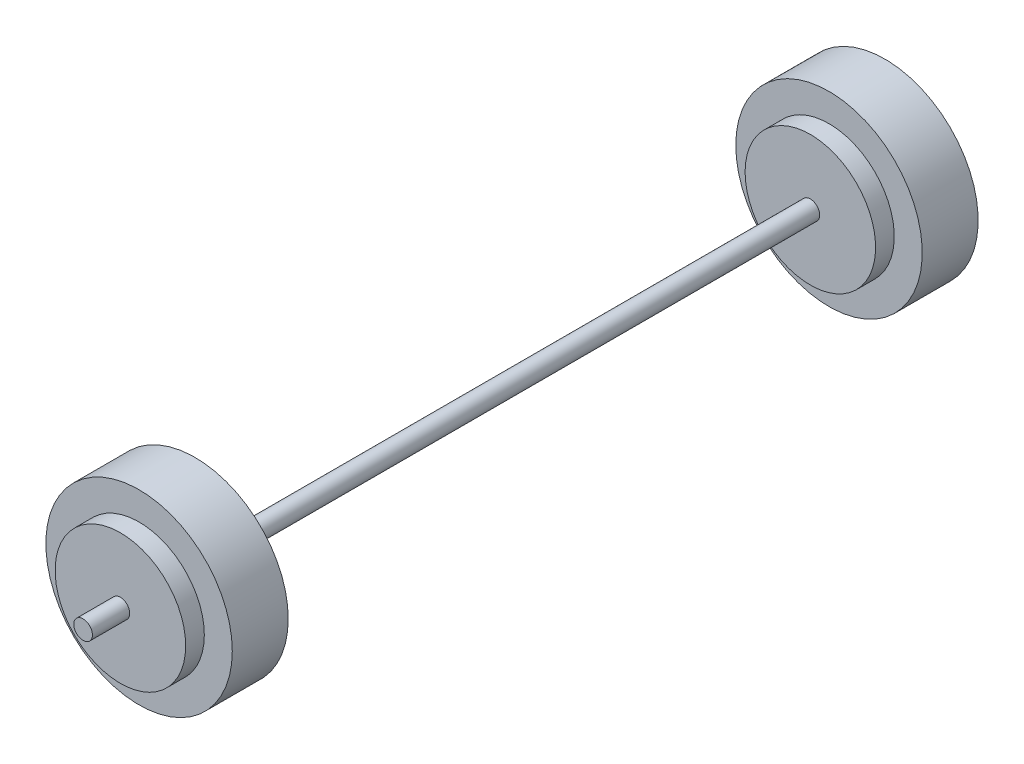
ISO-10303-21;
HEADER;
FILE_DESCRIPTION(('STEP AP214'),'2;1');
FILE_NAME('part.step','',(''),(''),'','','');
FILE_SCHEMA(('AUTOMOTIVE_DESIGN { 1 0 10303 214 1 1 1 1 }'));
ENDSEC;
DATA;
#1=APPLICATION_CONTEXT('core data for automotive mechanical design processes');
#2=APPLICATION_PROTOCOL_DEFINITION('international standard','automotive_design',2000,#1);
#3=PRODUCT_CONTEXT('',#1,'mechanical');
#4=PRODUCT('Part','Part','',(#3));
#5=PRODUCT_RELATED_PRODUCT_CATEGORY('part','',(#4));
#6=PRODUCT_DEFINITION_FORMATION('','',#4);
#7=PRODUCT_DEFINITION_CONTEXT('part definition',#1,'design');
#8=PRODUCT_DEFINITION('design','',#6,#7);
#9=PRODUCT_DEFINITION_SHAPE('','',#8);
#10=(LENGTH_UNIT() NAMED_UNIT(*) SI_UNIT(.MILLI.,.METRE.));
#11=(NAMED_UNIT(*) PLANE_ANGLE_UNIT() SI_UNIT($,.RADIAN.));
#12=(NAMED_UNIT(*) SI_UNIT($,.STERADIAN.) SOLID_ANGLE_UNIT());
#13=UNCERTAINTY_MEASURE_WITH_UNIT(LENGTH_MEASURE(1.E-05),#10,'distance_accuracy_value','');
#14=(GEOMETRIC_REPRESENTATION_CONTEXT(3) GLOBAL_UNCERTAINTY_ASSIGNED_CONTEXT((#13)) GLOBAL_UNIT_ASSIGNED_CONTEXT((#10,
#11,#12)) REPRESENTATION_CONTEXT('',''));
#15=CARTESIAN_POINT('',(0.,0.,0.));
#16=DIRECTION('',(0.,0.,1.));
#17=DIRECTION('',(1.,0.,0.));
#18=AXIS2_PLACEMENT_3D('',#15,#16,#17);
#19=CARTESIAN_POINT('',(0.,0.,-76.2));
#20=DIRECTION('',(0.,0.,1.));
#21=DIRECTION('',(1.,0.,0.));
#22=AXIS2_PLACEMENT_3D('',#19,#20,#21);
#23=CYLINDRICAL_SURFACE('',#22,127.);
#24=CARTESIAN_POINT('',(0.,0.,-76.2));
#25=DIRECTION('',(0.,0.,1.));
#26=DIRECTION('',(1.,0.,0.));
#27=AXIS2_PLACEMENT_3D('',#24,#25,#26);
#28=CIRCLE('',#27,127.);
#29=CARTESIAN_POINT('',(127.,0.,-76.2));
#30=VERTEX_POINT('',#29);
#31=EDGE_CURVE('E36',#30,#30,#28,.T.);
#32=ORIENTED_EDGE('',*,*,#31,.T.);
#33=EDGE_LOOP('',(#32));
#34=FACE_BOUND('',#33,.T.);
#35=CARTESIAN_POINT('',(0.,0.,0.));
#36=DIRECTION('',(0.,0.,1.));
#37=DIRECTION('',(1.,0.,0.));
#38=AXIS2_PLACEMENT_3D('',#35,#36,#37);
#39=CIRCLE('',#38,127.);
#40=CARTESIAN_POINT('',(127.,0.,0.));
#41=VERTEX_POINT('',#40);
#42=EDGE_CURVE('E40',#41,#41,#39,.T.);
#43=ORIENTED_EDGE('',*,*,#42,.F.);
#44=EDGE_LOOP('',(#43));
#45=FACE_BOUND('',#44,.T.);
#46=ADVANCED_FACE('F30',(#34,#45),#23,.T.);
#47=CARTESIAN_POINT('',(0.,0.,-76.2));
#48=DIRECTION('',(0.,0.,1.));
#49=DIRECTION('',(1.,0.,0.));
#50=AXIS2_PLACEMENT_3D('',#47,#48,#49);
#51=PLANE('',#50);
#52=CARTESIAN_POINT('',(0.,0.,-76.2));
#53=DIRECTION('',(0.,0.,1.));
#54=DIRECTION('',(1.,0.,0.));
#55=AXIS2_PLACEMENT_3D('',#52,#53,#54);
#56=CIRCLE('',#55,88.9);
#57=CARTESIAN_POINT('',(88.9,0.,-76.2));
#58=VERTEX_POINT('',#57);
#59=EDGE_CURVE('E10',#58,#58,#56,.F.);
#60=ORIENTED_EDGE('',*,*,#59,.F.);
#61=EDGE_LOOP('',(#60));
#62=FACE_BOUND('',#61,.T.);
#63=ORIENTED_EDGE('',*,*,#31,.F.);
#64=EDGE_LOOP('',(#63));
#65=FACE_BOUND('',#64,.T.);
#66=ADVANCED_FACE('F132',(#62,#65),#51,.F.);
#67=CARTESIAN_POINT('',(0.,0.,0.));
#68=DIRECTION('',(0.,0.,1.));
#69=DIRECTION('',(1.,0.,0.));
#70=AXIS2_PLACEMENT_3D('',#67,#68,#69);
#71=PLANE('',#70);
#72=CARTESIAN_POINT('',(0.,0.,0.));
#73=DIRECTION('',(0.,0.,1.));
#74=DIRECTION('',(1.,0.,0.));
#75=AXIS2_PLACEMENT_3D('',#72,#73,#74);
#76=CIRCLE('',#75,88.9);
#77=CARTESIAN_POINT('',(88.9,0.,0.));
#78=VERTEX_POINT('',#77);
#79=EDGE_CURVE('E47',#78,#78,#76,.T.);
#80=ORIENTED_EDGE('',*,*,#79,.F.);
#81=EDGE_LOOP('',(#80));
#82=FACE_BOUND('',#81,.T.);
#83=ORIENTED_EDGE('',*,*,#42,.T.);
#84=EDGE_LOOP('',(#83));
#85=FACE_BOUND('',#84,.T.);
#86=ADVANCED_FACE('F136',(#82,#85),#71,.T.);
#87=CARTESIAN_POINT('',(0.,0.,25.4));
#88=DIRECTION('',(0.,0.,-1.));
#89=DIRECTION('',(-1.,0.,0.));
#90=AXIS2_PLACEMENT_3D('',#87,#88,#89);
#91=CYLINDRICAL_SURFACE('',#90,88.9);
#92=CARTESIAN_POINT('',(0.,0.,25.4));
#93=DIRECTION('',(0.,0.,1.));
#94=DIRECTION('',(1.,0.,0.));
#95=AXIS2_PLACEMENT_3D('',#92,#93,#94);
#96=CIRCLE('',#95,88.9);
#97=CARTESIAN_POINT('',(88.9,0.,25.4));
#98=VERTEX_POINT('',#97);
#99=EDGE_CURVE('E45',#98,#98,#96,.T.);
#100=ORIENTED_EDGE('',*,*,#99,.F.);
#101=EDGE_LOOP('',(#100));
#102=FACE_BOUND('',#101,.T.);
#103=ORIENTED_EDGE('',*,*,#79,.T.);
#104=EDGE_LOOP('',(#103));
#105=FACE_BOUND('',#104,.T.);
#106=ADVANCED_FACE('F143',(#102,#105),#91,.T.);
#107=CARTESIAN_POINT('',(0.,0.,25.4));
#108=DIRECTION('',(0.,0.,1.));
#109=DIRECTION('',(1.,0.,0.));
#110=AXIS2_PLACEMENT_3D('',#107,#108,#109);
#111=PLANE('',#110);
#112=CARTESIAN_POINT('',(0.,0.,25.4));
#113=DIRECTION('',(0.,0.,1.));
#114=DIRECTION('',(1.,0.,0.));
#115=AXIS2_PLACEMENT_3D('',#112,#113,#114);
#116=CIRCLE('',#115,12.7);
#117=CARTESIAN_POINT('',(12.7,0.,25.4));
#118=VERTEX_POINT('',#117);
#119=EDGE_CURVE('E53',#118,#118,#116,.T.);
#120=ORIENTED_EDGE('',*,*,#119,.F.);
#121=EDGE_LOOP('',(#120));
#122=FACE_BOUND('',#121,.T.);
#123=ORIENTED_EDGE('',*,*,#99,.T.);
#124=EDGE_LOOP('',(#123));
#125=FACE_BOUND('',#124,.T.);
#126=ADVANCED_FACE('F148',(#122,#125),#111,.T.);
#127=CARTESIAN_POINT('',(0.,0.,76.2));
#128=DIRECTION('',(0.,0.,-1.));
#129=DIRECTION('',(-1.,0.,0.));
#130=AXIS2_PLACEMENT_3D('',#127,#128,#129);
#131=CYLINDRICAL_SURFACE('',#130,12.7);
#132=CARTESIAN_POINT('',(0.,0.,76.2));
#133=DIRECTION('',(0.,0.,1.));
#134=DIRECTION('',(1.,0.,0.));
#135=AXIS2_PLACEMENT_3D('',#132,#133,#134);
#136=CIRCLE('',#135,12.7);
#137=CARTESIAN_POINT('',(12.7,0.,76.2));
#138=VERTEX_POINT('',#137);
#139=EDGE_CURVE('E50',#138,#138,#136,.T.);
#140=ORIENTED_EDGE('',*,*,#139,.F.);
#141=EDGE_LOOP('',(#140));
#142=FACE_BOUND('',#141,.T.);
#143=ORIENTED_EDGE('',*,*,#119,.T.);
#144=EDGE_LOOP('',(#143));
#145=FACE_BOUND('',#144,.T.);
#146=ADVANCED_FACE('F155',(#142,#145),#131,.T.);
#147=CARTESIAN_POINT('',(0.,0.,76.2));
#148=DIRECTION('',(0.,0.,1.));
#149=DIRECTION('',(1.,0.,0.));
#150=AXIS2_PLACEMENT_3D('',#147,#148,#149);
#151=PLANE('',#150);
#152=ORIENTED_EDGE('',*,*,#139,.T.);
#153=EDGE_LOOP('',(#152));
#154=FACE_BOUND('',#153,.T.);
#155=ADVANCED_FACE('F159',(#154),#151,.T.);
#156=CARTESIAN_POINT('',(0.,0.,-101.6));
#157=DIRECTION('',(0.,0.,1.));
#158=DIRECTION('',(1.,0.,0.));
#159=AXIS2_PLACEMENT_3D('',#156,#157,#158);
#160=CYLINDRICAL_SURFACE('',#159,88.9);
#161=CARTESIAN_POINT('',(0.,0.,-101.6));
#162=DIRECTION('',(0.,0.,-1.));
#163=DIRECTION('',(-1.,0.,0.));
#164=AXIS2_PLACEMENT_3D('',#161,#162,#163);
#165=CIRCLE('',#164,88.9);
#166=CARTESIAN_POINT('',(-88.9,0.,-101.6));
#167=VERTEX_POINT('',#166);
#168=EDGE_CURVE('E56',#167,#167,#165,.T.);
#169=ORIENTED_EDGE('',*,*,#168,.F.);
#170=EDGE_LOOP('',(#169));
#171=FACE_BOUND('',#170,.T.);
#172=ORIENTED_EDGE('',*,*,#59,.T.);
#173=EDGE_LOOP('',(#172));
#174=FACE_BOUND('',#173,.T.);
#175=ADVANCED_FACE('F163',(#171,#174),#160,.T.);
#176=CARTESIAN_POINT('',(0.,0.,-101.6));
#177=DIRECTION('',(0.,0.,-1.));
#178=DIRECTION('',(-1.,0.,0.));
#179=AXIS2_PLACEMENT_3D('',#176,#177,#178);
#180=PLANE('',#179);
#181=CARTESIAN_POINT('',(0.,0.,-101.6));
#182=DIRECTION('',(0.,0.,-1.));
#183=DIRECTION('',(-1.,0.,0.));
#184=AXIS2_PLACEMENT_3D('',#181,#182,#183);
#185=CIRCLE('',#184,12.7);
#186=CARTESIAN_POINT('',(-12.7,0.,-101.6));
#187=VERTEX_POINT('',#186);
#188=EDGE_CURVE('E62',#187,#187,#185,.T.);
#189=ORIENTED_EDGE('',*,*,#188,.F.);
#190=EDGE_LOOP('',(#189));
#191=FACE_BOUND('',#190,.T.);
#192=ORIENTED_EDGE('',*,*,#168,.T.);
#193=EDGE_LOOP('',(#192));
#194=FACE_BOUND('',#193,.T.);
#195=ADVANCED_FACE('F167',(#191,#194),#180,.T.);
#196=CARTESIAN_POINT('',(0.,0.,-914.4));
#197=DIRECTION('',(0.,0.,1.));
#198=DIRECTION('',(1.,0.,0.));
#199=AXIS2_PLACEMENT_3D('',#196,#197,#198);
#200=CYLINDRICAL_SURFACE('',#199,12.7);
#201=CARTESIAN_POINT('',(0.,0.,-914.4));
#202=DIRECTION('',(0.,0.,-1.));
#203=DIRECTION('',(-1.,0.,0.));
#204=AXIS2_PLACEMENT_3D('',#201,#202,#203);
#205=CIRCLE('',#204,12.7);
#206=CARTESIAN_POINT('',(-12.7,0.,-914.4));
#207=VERTEX_POINT('',#206);
#208=EDGE_CURVE('E61',#207,#207,#205,.T.);
#209=ORIENTED_EDGE('',*,*,#208,.F.);
#210=EDGE_LOOP('',(#209));
#211=FACE_BOUND('',#210,.T.);
#212=ORIENTED_EDGE('',*,*,#188,.T.);
#213=EDGE_LOOP('',(#212));
#214=FACE_BOUND('',#213,.T.);
#215=ADVANCED_FACE('F171',(#211,#214),#200,.T.);
#216=CARTESIAN_POINT('',(0.,0.,-939.8));
#217=DIRECTION('',(0.,0.,1.));
#218=DIRECTION('',(1.,0.,0.));
#219=AXIS2_PLACEMENT_3D('',#216,#217,#218);
#220=CYLINDRICAL_SURFACE('',#219,88.9);
#221=CARTESIAN_POINT('',(0.,0.,-939.8));
#222=DIRECTION('',(0.,0.,-1.));
#223=DIRECTION('',(-1.,0.,0.));
#224=AXIS2_PLACEMENT_3D('',#221,#222,#223);
#225=CIRCLE('',#224,88.9);
#226=CARTESIAN_POINT('',(-88.9,0.,-939.8));
#227=VERTEX_POINT('',#226);
#228=EDGE_CURVE('E65',#227,#227,#225,.T.);
#229=ORIENTED_EDGE('',*,*,#228,.F.);
#230=EDGE_LOOP('',(#229));
#231=FACE_BOUND('',#230,.T.);
#232=CARTESIAN_POINT('',(0.,0.,-914.4));
#233=DIRECTION('',(0.,0.,-1.));
#234=DIRECTION('',(-1.,0.,0.));
#235=AXIS2_PLACEMENT_3D('',#232,#233,#234);
#236=CIRCLE('',#235,88.9);
#237=CARTESIAN_POINT('',(-88.9,0.,-914.4));
#238=VERTEX_POINT('',#237);
#239=EDGE_CURVE('E68',#238,#238,#236,.T.);
#240=ORIENTED_EDGE('',*,*,#239,.T.);
#241=EDGE_LOOP('',(#240));
#242=FACE_BOUND('',#241,.T.);
#243=ADVANCED_FACE('F175',(#231,#242),#220,.T.);
#244=CARTESIAN_POINT('',(0.,0.,-914.4));
#245=DIRECTION('',(0.,0.,-1.));
#246=DIRECTION('',(-1.,0.,0.));
#247=AXIS2_PLACEMENT_3D('',#244,#245,#246);
#248=PLANE('',#247);
#249=ORIENTED_EDGE('',*,*,#208,.T.);
#250=EDGE_LOOP('',(#249));
#251=FACE_BOUND('',#250,.T.);
#252=ORIENTED_EDGE('',*,*,#239,.F.);
#253=EDGE_LOOP('',(#252));
#254=FACE_BOUND('',#253,.T.);
#255=ADVANCED_FACE('F122',(#251,#254),#248,.F.);
#256=CARTESIAN_POINT('',(0.,0.,-1016.));
#257=DIRECTION('',(0.,0.,1.));
#258=DIRECTION('',(1.,0.,0.));
#259=AXIS2_PLACEMENT_3D('',#256,#257,#258);
#260=CYLINDRICAL_SURFACE('',#259,127.);
#261=CARTESIAN_POINT('',(0.,0.,-1016.));
#262=DIRECTION('',(0.,0.,-1.));
#263=DIRECTION('',(-1.,0.,0.));
#264=AXIS2_PLACEMENT_3D('',#261,#262,#263);
#265=CIRCLE('',#264,127.);
#266=CARTESIAN_POINT('',(-127.,0.,-1016.));
#267=VERTEX_POINT('',#266);
#268=EDGE_CURVE('E71',#267,#267,#265,.T.);
#269=ORIENTED_EDGE('',*,*,#268,.F.);
#270=EDGE_LOOP('',(#269));
#271=FACE_BOUND('',#270,.T.);
#272=CARTESIAN_POINT('',(0.,0.,-939.8));
#273=DIRECTION('',(0.,0.,-1.));
#274=DIRECTION('',(-1.,0.,0.));
#275=AXIS2_PLACEMENT_3D('',#272,#273,#274);
#276=CIRCLE('',#275,127.);
#277=CARTESIAN_POINT('',(-127.,0.,-939.8));
#278=VERTEX_POINT('',#277);
#279=EDGE_CURVE('E74',#278,#278,#276,.T.);
#280=ORIENTED_EDGE('',*,*,#279,.T.);
#281=EDGE_LOOP('',(#280));
#282=FACE_BOUND('',#281,.T.);
#283=ADVANCED_FACE('F116',(#271,#282),#260,.T.);
#284=CARTESIAN_POINT('',(0.,0.,-1016.));
#285=DIRECTION('',(0.,0.,-1.));
#286=DIRECTION('',(-1.,0.,0.));
#287=AXIS2_PLACEMENT_3D('',#284,#285,#286);
#288=PLANE('',#287);
#289=CARTESIAN_POINT('',(0.,0.,-1016.));
#290=DIRECTION('',(0.,0.,-1.));
#291=DIRECTION('',(-1.,0.,0.));
#292=AXIS2_PLACEMENT_3D('',#289,#290,#291);
#293=CIRCLE('',#292,88.9);
#294=CARTESIAN_POINT('',(-88.9,0.,-1016.));
#295=VERTEX_POINT('',#294);
#296=EDGE_CURVE('E80',#295,#295,#293,.T.);
#297=ORIENTED_EDGE('',*,*,#296,.F.);
#298=EDGE_LOOP('',(#297));
#299=FACE_BOUND('',#298,.T.);
#300=ORIENTED_EDGE('',*,*,#268,.T.);
#301=EDGE_LOOP('',(#300));
#302=FACE_BOUND('',#301,.T.);
#303=ADVANCED_FACE('F113',(#299,#302),#288,.T.);
#304=CARTESIAN_POINT('',(0.,0.,-939.8));
#305=DIRECTION('',(0.,0.,-1.));
#306=DIRECTION('',(-1.,0.,0.));
#307=AXIS2_PLACEMENT_3D('',#304,#305,#306);
#308=PLANE('',#307);
#309=ORIENTED_EDGE('',*,*,#228,.T.);
#310=EDGE_LOOP('',(#309));
#311=FACE_BOUND('',#310,.T.);
#312=ORIENTED_EDGE('',*,*,#279,.F.);
#313=EDGE_LOOP('',(#312));
#314=FACE_BOUND('',#313,.T.);
#315=ADVANCED_FACE('F109',(#311,#314),#308,.F.);
#316=CARTESIAN_POINT('',(0.,0.,-1041.4));
#317=DIRECTION('',(0.,0.,1.));
#318=DIRECTION('',(1.,0.,0.));
#319=AXIS2_PLACEMENT_3D('',#316,#317,#318);
#320=CYLINDRICAL_SURFACE('',#319,88.9);
#321=CARTESIAN_POINT('',(0.,0.,-1041.4));
#322=DIRECTION('',(0.,0.,-1.));
#323=DIRECTION('',(-1.,0.,0.));
#324=AXIS2_PLACEMENT_3D('',#321,#322,#323);
#325=CIRCLE('',#324,88.9);
#326=CARTESIAN_POINT('',(-88.9,0.,-1041.4));
#327=VERTEX_POINT('',#326);
#328=EDGE_CURVE('E77',#327,#327,#325,.T.);
#329=ORIENTED_EDGE('',*,*,#328,.F.);
#330=EDGE_LOOP('',(#329));
#331=FACE_BOUND('',#330,.T.);
#332=ORIENTED_EDGE('',*,*,#296,.T.);
#333=EDGE_LOOP('',(#332));
#334=FACE_BOUND('',#333,.T.);
#335=ADVANCED_FACE('F103',(#331,#334),#320,.T.);
#336=CARTESIAN_POINT('',(0.,0.,-1041.4));
#337=DIRECTION('',(0.,0.,-1.));
#338=DIRECTION('',(-1.,0.,0.));
#339=AXIS2_PLACEMENT_3D('',#336,#337,#338);
#340=PLANE('',#339);
#341=CARTESIAN_POINT('',(0.,0.,-1041.4));
#342=DIRECTION('',(0.,0.,-1.));
#343=DIRECTION('',(-1.,0.,0.));
#344=AXIS2_PLACEMENT_3D('',#341,#342,#343);
#345=CIRCLE('',#344,12.7);
#346=CARTESIAN_POINT('',(-12.7,0.,-1041.4));
#347=VERTEX_POINT('',#346);
#348=EDGE_CURVE('E86',#347,#347,#345,.T.);
#349=ORIENTED_EDGE('',*,*,#348,.F.);
#350=EDGE_LOOP('',(#349));
#351=FACE_BOUND('',#350,.T.);
#352=ORIENTED_EDGE('',*,*,#328,.T.);
#353=EDGE_LOOP('',(#352));
#354=FACE_BOUND('',#353,.T.);
#355=ADVANCED_FACE('F97',(#351,#354),#340,.T.);
#356=CARTESIAN_POINT('',(0.,0.,-1092.2));
#357=DIRECTION('',(0.,0.,1.));
#358=DIRECTION('',(1.,0.,0.));
#359=AXIS2_PLACEMENT_3D('',#356,#357,#358);
#360=CYLINDRICAL_SURFACE('',#359,12.7);
#361=CARTESIAN_POINT('',(0.,0.,-1092.2));
#362=DIRECTION('',(0.,0.,-1.));
#363=DIRECTION('',(-1.,0.,0.));
#364=AXIS2_PLACEMENT_3D('',#361,#362,#363);
#365=CIRCLE('',#364,12.7);
#366=CARTESIAN_POINT('',(-12.7,0.,-1092.2));
#367=VERTEX_POINT('',#366);
#368=EDGE_CURVE('E83',#367,#367,#365,.T.);
#369=ORIENTED_EDGE('',*,*,#368,.F.);
#370=EDGE_LOOP('',(#369));
#371=FACE_BOUND('',#370,.T.);
#372=ORIENTED_EDGE('',*,*,#348,.T.);
#373=EDGE_LOOP('',(#372));
#374=FACE_BOUND('',#373,.T.);
#375=ADVANCED_FACE('F94',(#371,#374),#360,.T.);
#376=CARTESIAN_POINT('',(0.,0.,-1092.2));
#377=DIRECTION('',(0.,0.,-1.));
#378=DIRECTION('',(-1.,0.,0.));
#379=AXIS2_PLACEMENT_3D('',#376,#377,#378);
#380=PLANE('',#379);
#381=ORIENTED_EDGE('',*,*,#368,.T.);
#382=EDGE_LOOP('',(#381));
#383=FACE_BOUND('',#382,.T.);
#384=ADVANCED_FACE('F92',(#383),#380,.T.);
#385=CLOSED_SHELL('',(#46,#66,#86,#106,#126,#146,#155,#175,#195,#215,#243,#255,#283,#303,#315,
#335,#355,#375,#384));
#386=MANIFOLD_SOLID_BREP('B2',#385);
#387=ADVANCED_BREP_SHAPE_REPRESENTATION('',(#18,#386),#14);
#388=SHAPE_DEFINITION_REPRESENTATION(#9,#387);
ENDSEC;
END-ISO-10303-21;
